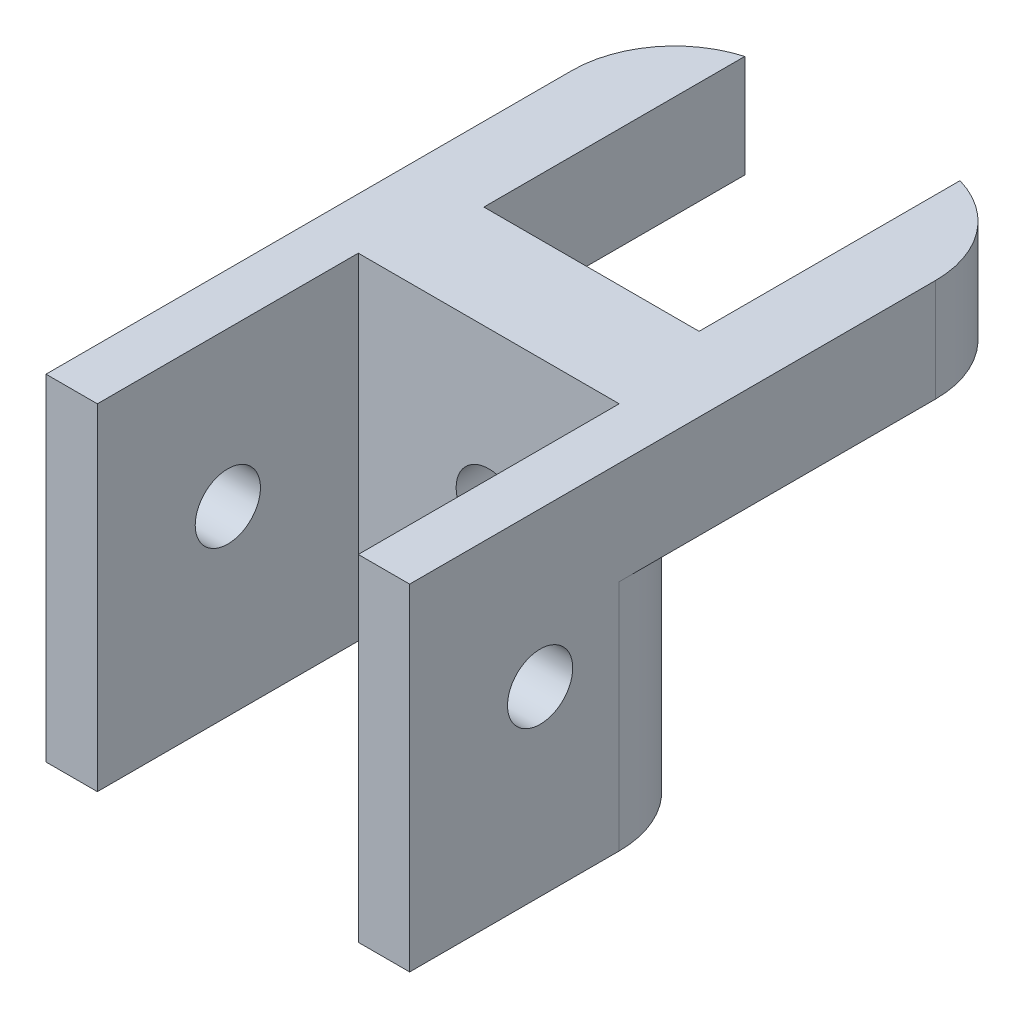
ISO-10303-21;
HEADER;
FILE_DESCRIPTION(('STEP AP214'),'2;1');
FILE_NAME('part.step','',(''),(''),'','','');
FILE_SCHEMA(('AUTOMOTIVE_DESIGN { 1 0 10303 214 1 1 1 1 }'));
ENDSEC;
DATA;
#1=APPLICATION_CONTEXT('core data for automotive mechanical design processes');
#2=APPLICATION_PROTOCOL_DEFINITION('international standard','automotive_design',2000,#1);
#3=PRODUCT_CONTEXT('',#1,'mechanical');
#4=PRODUCT('Part','Part','',(#3));
#5=PRODUCT_RELATED_PRODUCT_CATEGORY('part','',(#4));
#6=PRODUCT_DEFINITION_FORMATION('','',#4);
#7=PRODUCT_DEFINITION_CONTEXT('part definition',#1,'design');
#8=PRODUCT_DEFINITION('design','',#6,#7);
#9=PRODUCT_DEFINITION_SHAPE('','',#8);
#10=(LENGTH_UNIT() NAMED_UNIT(*) SI_UNIT(.MILLI.,.METRE.));
#11=(NAMED_UNIT(*) PLANE_ANGLE_UNIT() SI_UNIT($,.RADIAN.));
#12=(NAMED_UNIT(*) SI_UNIT($,.STERADIAN.) SOLID_ANGLE_UNIT());
#13=UNCERTAINTY_MEASURE_WITH_UNIT(LENGTH_MEASURE(1.E-05),#10,'distance_accuracy_value','');
#14=(GEOMETRIC_REPRESENTATION_CONTEXT(3) GLOBAL_UNCERTAINTY_ASSIGNED_CONTEXT((#13)) GLOBAL_UNIT_ASSIGNED_CONTEXT((#10,
#11,#12)) REPRESENTATION_CONTEXT('',''));
#15=CARTESIAN_POINT('',(0.,0.,0.));
#16=DIRECTION('',(0.,0.,1.));
#17=DIRECTION('',(1.,0.,0.));
#18=AXIS2_PLACEMENT_3D('',#15,#16,#17);
#19=CARTESIAN_POINT('',(-17.7,-10.,10.605));
#20=DIRECTION('',(0.,0.,1.));
#21=DIRECTION('',(1.,0.,0.));
#22=AXIS2_PLACEMENT_3D('',#19,#20,#21);
#23=PLANE('',#22);
#24=DIRECTION('',(0.,-1.,0.));
#25=VECTOR('',#24,1.);
#26=CARTESIAN_POINT('',(-10.475,-10.,10.605));
#27=LINE('',#26,#25);
#28=CARTESIAN_POINT('',(-10.475,0.,10.605));
#29=VERTEX_POINT('',#28);
#30=CARTESIAN_POINT('',(-10.475,-10.,10.605));
#31=VERTEX_POINT('',#30);
#32=EDGE_CURVE('E183',#29,#31,#27,.T.);
#33=ORIENTED_EDGE('',*,*,#32,.F.);
#34=DIRECTION('',(1.,0.,0.));
#35=VECTOR('',#34,1.);
#36=CARTESIAN_POINT('',(-17.7,0.,10.605));
#37=LINE('',#36,#35);
#38=CARTESIAN_POINT('',(10.475,0.,10.605));
#39=VERTEX_POINT('',#38);
#40=EDGE_CURVE('E172',#29,#39,#37,.T.);
#41=ORIENTED_EDGE('',*,*,#40,.T.);
#42=DIRECTION('',(0.,1.,0.));
#43=VECTOR('',#42,1.);
#44=CARTESIAN_POINT('',(10.475,-10.,10.605));
#45=LINE('',#44,#43);
#46=CARTESIAN_POINT('',(10.475,-10.,10.605));
#47=VERTEX_POINT('',#46);
#48=EDGE_CURVE('E188',#47,#39,#45,.T.);
#49=ORIENTED_EDGE('',*,*,#48,.F.);
#50=DIRECTION('',(1.,0.,0.));
#51=VECTOR('',#50,1.);
#52=CARTESIAN_POINT('',(-17.7,-10.,10.605));
#53=LINE('',#52,#51);
#54=EDGE_CURVE('E300',#31,#47,#53,.T.);
#55=ORIENTED_EDGE('',*,*,#54,.F.);
#56=EDGE_LOOP('',(#33,#41,#49,#55));
#57=FACE_BOUND('',#56,.T.);
#58=ADVANCED_FACE('F45',(#57),#23,.F.);
#59=CARTESIAN_POINT('',(-17.7,-10.,20.605));
#60=DIRECTION('',(0.,0.,-1.));
#61=DIRECTION('',(-1.,0.,0.));
#62=AXIS2_PLACEMENT_3D('',#59,#60,#61);
#63=PLANE('',#62);
#64=CARTESIAN_POINT('',(0.,-15.,20.605));
#65=DIRECTION('',(0.,0.,-1.));
#66=DIRECTION('',(-1.,0.,0.));
#67=AXIS2_PLACEMENT_3D('',#64,#65,#66);
#68=CIRCLE('',#67,3.175);
#69=CARTESIAN_POINT('',(-3.175,-15.,20.605));
#70=VERTEX_POINT('',#69);
#71=EDGE_CURVE('E274',#70,#70,#68,.T.);
#72=ORIENTED_EDGE('',*,*,#71,.T.);
#73=EDGE_LOOP('',(#72));
#74=FACE_BOUND('',#73,.T.);
#75=DIRECTION('',(0.,1.,0.));
#76=VECTOR('',#75,1.);
#77=CARTESIAN_POINT('',(-12.7,0.,20.605));
#78=LINE('',#77,#76);
#79=CARTESIAN_POINT('',(-12.7,-32.7,20.605));
#80=VERTEX_POINT('',#79);
#81=CARTESIAN_POINT('',(-12.7,0.,20.605));
#82=VERTEX_POINT('',#81);
#83=EDGE_CURVE('E223',#80,#82,#78,.T.);
#84=ORIENTED_EDGE('',*,*,#83,.F.);
#85=DIRECTION('',(-1.,0.,0.));
#86=VECTOR('',#85,1.);
#87=CARTESIAN_POINT('',(-17.7,-32.7,20.605));
#88=LINE('',#87,#86);
#89=CARTESIAN_POINT('',(12.7,-32.7,20.605));
#90=VERTEX_POINT('',#89);
#91=EDGE_CURVE('E290',#90,#80,#88,.T.);
#92=ORIENTED_EDGE('',*,*,#91,.F.);
#93=DIRECTION('',(0.,-1.,0.));
#94=VECTOR('',#93,1.);
#95=CARTESIAN_POINT('',(12.7,0.,20.605));
#96=LINE('',#95,#94);
#97=CARTESIAN_POINT('',(12.7,0.,20.605));
#98=VERTEX_POINT('',#97);
#99=EDGE_CURVE('E237',#98,#90,#96,.T.);
#100=ORIENTED_EDGE('',*,*,#99,.F.);
#101=DIRECTION('',(-1.,0.,0.));
#102=VECTOR('',#101,1.);
#103=CARTESIAN_POINT('',(-17.7,0.,20.605));
#104=LINE('',#103,#102);
#105=EDGE_CURVE('E301',#98,#82,#104,.T.);
#106=ORIENTED_EDGE('',*,*,#105,.T.);
#107=EDGE_LOOP('',(#84,#92,#100,#106));
#108=FACE_BOUND('',#107,.T.);
#109=ADVANCED_FACE('F414',(#74,#108),#63,.F.);
#110=CARTESIAN_POINT('',(0.,-10.,0.));
#111=DIRECTION('',(0.,1.,0.));
#112=DIRECTION('',(0.,0.,1.));
#113=AXIS2_PLACEMENT_3D('',#110,#111,#112);
#114=PLANE('',#113);
#115=DIRECTION('',(0.,0.,1.));
#116=VECTOR('',#115,1.);
#117=CARTESIAN_POINT('',(10.475,-10.,-14.795));
#118=LINE('',#117,#116);
#119=CARTESIAN_POINT('',(10.475,-10.,-14.795));
#120=VERTEX_POINT('',#119);
#121=EDGE_CURVE('E191',#120,#47,#118,.T.);
#122=ORIENTED_EDGE('',*,*,#121,.F.);
#123=CARTESIAN_POINT('',(7.7,-10.,-5.18774362786127));
#124=DIRECTION('',(0.,1.,0.));
#125=DIRECTION('',(0.,0.,1.));
#126=AXIS2_PLACEMENT_3D('',#123,#124,#125);
#127=CIRCLE('',#126,10.);
#128=CARTESIAN_POINT('',(17.7,-10.,-5.18774362786127));
#129=VERTEX_POINT('',#128);
#130=EDGE_CURVE('E164',#120,#129,#127,.F.);
#131=ORIENTED_EDGE('',*,*,#130,.T.);
#132=DIRECTION('',(0.,0.,1.));
#133=VECTOR('',#132,1.);
#134=CARTESIAN_POINT('',(17.7,-10.,10.605));
#135=LINE('',#134,#133);
#136=CARTESIAN_POINT('',(17.7,-10.,25.605));
#137=VERTEX_POINT('',#136);
#138=EDGE_CURVE('E305',#129,#137,#135,.T.);
#139=ORIENTED_EDGE('',*,*,#138,.T.);
#140=CARTESIAN_POINT('',(7.7,-10.,25.605));
#141=DIRECTION('',(0.,1.,0.));
#142=DIRECTION('',(0.,0.,1.));
#143=AXIS2_PLACEMENT_3D('',#140,#141,#142);
#144=CIRCLE('',#143,10.);
#145=CARTESIAN_POINT('',(7.7,-10.,15.605));
#146=VERTEX_POINT('',#145);
#147=EDGE_CURVE('E54',#137,#146,#144,.T.);
#148=ORIENTED_EDGE('',*,*,#147,.T.);
#149=DIRECTION('',(1.,0.,0.));
#150=VECTOR('',#149,1.);
#151=CARTESIAN_POINT('',(-17.7,-10.,15.605));
#152=LINE('',#151,#150);
#153=CARTESIAN_POINT('',(-7.7,-10.,15.605));
#154=VERTEX_POINT('',#153);
#155=EDGE_CURVE('E278',#154,#146,#152,.T.);
#156=ORIENTED_EDGE('',*,*,#155,.F.);
#157=CARTESIAN_POINT('',(-7.7,-10.,25.605));
#158=DIRECTION('',(0.,1.,0.));
#159=DIRECTION('',(0.,0.,1.));
#160=AXIS2_PLACEMENT_3D('',#157,#158,#159);
#161=CIRCLE('',#160,10.);
#162=CARTESIAN_POINT('',(-17.7,-10.,25.605));
#163=VERTEX_POINT('',#162);
#164=EDGE_CURVE('E11',#154,#163,#161,.T.);
#165=ORIENTED_EDGE('',*,*,#164,.T.);
#166=DIRECTION('',(0.,0.,-1.));
#167=VECTOR('',#166,1.);
#168=CARTESIAN_POINT('',(-17.7,-10.,10.605));
#169=LINE('',#168,#167);
#170=CARTESIAN_POINT('',(-17.7,-10.,-5.18774362786127));
#171=VERTEX_POINT('',#170);
#172=EDGE_CURVE('E61',#163,#171,#169,.T.);
#173=ORIENTED_EDGE('',*,*,#172,.T.);
#174=CARTESIAN_POINT('',(-7.70000000000001,-10.,-5.18774362786127));
#175=DIRECTION('',(0.,1.,0.));
#176=DIRECTION('',(0.,0.,1.));
#177=AXIS2_PLACEMENT_3D('',#174,#175,#176);
#178=CIRCLE('',#177,10.);
#179=CARTESIAN_POINT('',(-10.475,-10.,-14.795));
#180=VERTEX_POINT('',#179);
#181=EDGE_CURVE('E345',#171,#180,#178,.F.);
#182=ORIENTED_EDGE('',*,*,#181,.T.);
#183=DIRECTION('',(0.,0.,1.));
#184=VECTOR('',#183,1.);
#185=CARTESIAN_POINT('',(-10.475,-10.,-14.795));
#186=LINE('',#185,#184);
#187=EDGE_CURVE('E177',#180,#31,#186,.T.);
#188=ORIENTED_EDGE('',*,*,#187,.T.);
#189=ORIENTED_EDGE('',*,*,#54,.T.);
#190=EDGE_LOOP('',(#122,#131,#139,#148,#156,#165,#173,#182,#188,#189));
#191=FACE_BOUND('',#190,.T.);
#192=ADVANCED_FACE('F356',(#191),#114,.F.);
#193=CARTESIAN_POINT('',(-17.7,-10.,10.605));
#194=DIRECTION('',(1.,0.,0.));
#195=DIRECTION('',(0.,0.,-1.));
#196=AXIS2_PLACEMENT_3D('',#193,#194,#195);
#197=PLANE('',#196);
#198=CARTESIAN_POINT('',(-17.7,-15.,33.305));
#199=DIRECTION('',(1.,0.,0.));
#200=DIRECTION('',(0.,0.,-1.));
#201=AXIS2_PLACEMENT_3D('',#198,#199,#200);
#202=CIRCLE('',#201,3.175);
#203=CARTESIAN_POINT('',(-17.7,-15.,30.13));
#204=VERTEX_POINT('',#203);
#205=EDGE_CURVE('E213',#204,#204,#202,.T.);
#206=ORIENTED_EDGE('',*,*,#205,.T.);
#207=EDGE_LOOP('',(#206));
#208=FACE_BOUND('',#207,.T.);
#209=ORIENTED_EDGE('',*,*,#172,.F.);
#210=DIRECTION('',(0.,1.,0.));
#211=VECTOR('',#210,1.);
#212=CARTESIAN_POINT('',(-17.7,-10.,25.605));
#213=LINE('',#212,#211);
#214=CARTESIAN_POINT('',(-17.7,-32.7,25.605));
#215=VERTEX_POINT('',#214);
#216=EDGE_CURVE('E342',#163,#215,#213,.F.);
#217=ORIENTED_EDGE('',*,*,#216,.T.);
#218=DIRECTION('',(0.,0.,-1.));
#219=VECTOR('',#218,1.);
#220=CARTESIAN_POINT('',(-17.7,-32.7,20.605));
#221=LINE('',#220,#219);
#222=CARTESIAN_POINT('',(-17.7,-32.7,46.005));
#223=VERTEX_POINT('',#222);
#224=EDGE_CURVE('E279',#223,#215,#221,.T.);
#225=ORIENTED_EDGE('',*,*,#224,.F.);
#226=DIRECTION('',(0.,-1.,0.));
#227=VECTOR('',#226,1.);
#228=CARTESIAN_POINT('',(-17.7,0.,46.005));
#229=LINE('',#228,#227);
#230=CARTESIAN_POINT('',(-17.7,0.,46.005));
#231=VERTEX_POINT('',#230);
#232=EDGE_CURVE('E218',#231,#223,#229,.T.);
#233=ORIENTED_EDGE('',*,*,#232,.F.);
#234=DIRECTION('',(0.,0.,-1.));
#235=VECTOR('',#234,1.);
#236=CARTESIAN_POINT('',(-17.7,0.,10.605));
#237=LINE('',#236,#235);
#238=CARTESIAN_POINT('',(-17.7,0.,-5.18774362786127));
#239=VERTEX_POINT('',#238);
#240=EDGE_CURVE('E294',#231,#239,#237,.T.);
#241=ORIENTED_EDGE('',*,*,#240,.T.);
#242=DIRECTION('',(0.,1.,0.));
#243=VECTOR('',#242,1.);
#244=CARTESIAN_POINT('',(-17.7,-10.,-5.18774362786127));
#245=LINE('',#244,#243);
#246=EDGE_CURVE('E65',#239,#171,#245,.F.);
#247=ORIENTED_EDGE('',*,*,#246,.T.);
#248=EDGE_LOOP('',(#209,#217,#225,#233,#241,#247));
#249=FACE_BOUND('',#248,.T.);
#250=ADVANCED_FACE('F425',(#208,#249),#197,.F.);
#251=CARTESIAN_POINT('',(17.7,-10.,10.605));
#252=DIRECTION('',(-1.,0.,0.));
#253=DIRECTION('',(0.,0.,1.));
#254=AXIS2_PLACEMENT_3D('',#251,#252,#253);
#255=PLANE('',#254);
#256=CARTESIAN_POINT('',(17.7,-15.,33.305));
#257=DIRECTION('',(1.,0.,0.));
#258=DIRECTION('',(0.,0.,-1.));
#259=AXIS2_PLACEMENT_3D('',#256,#257,#258);
#260=CIRCLE('',#259,3.175);
#261=CARTESIAN_POINT('',(17.7,-15.,30.13));
#262=VERTEX_POINT('',#261);
#263=EDGE_CURVE('E176',#262,#262,#260,.T.);
#264=ORIENTED_EDGE('',*,*,#263,.F.);
#265=EDGE_LOOP('',(#264));
#266=FACE_BOUND('',#265,.T.);
#267=DIRECTION('',(0.,0.,1.));
#268=VECTOR('',#267,1.);
#269=CARTESIAN_POINT('',(17.7,-32.7,20.605));
#270=LINE('',#269,#268);
#271=CARTESIAN_POINT('',(17.7,-32.7,25.605));
#272=VERTEX_POINT('',#271);
#273=CARTESIAN_POINT('',(17.7,-32.7,46.005));
#274=VERTEX_POINT('',#273);
#275=EDGE_CURVE('E287',#272,#274,#270,.T.);
#276=ORIENTED_EDGE('',*,*,#275,.F.);
#277=DIRECTION('',(0.,1.,0.));
#278=VECTOR('',#277,1.);
#279=CARTESIAN_POINT('',(17.7,-10.,25.605));
#280=LINE('',#279,#278);
#281=EDGE_CURVE('E323',#272,#137,#280,.T.);
#282=ORIENTED_EDGE('',*,*,#281,.T.);
#283=ORIENTED_EDGE('',*,*,#138,.F.);
#284=DIRECTION('',(0.,1.,0.));
#285=VECTOR('',#284,1.);
#286=CARTESIAN_POINT('',(17.7,-10.,-5.18774362786127));
#287=LINE('',#286,#285);
#288=CARTESIAN_POINT('',(17.7,0.,-5.18774362786127));
#289=VERTEX_POINT('',#288);
#290=EDGE_CURVE('E308',#129,#289,#287,.T.);
#291=ORIENTED_EDGE('',*,*,#290,.T.);
#292=DIRECTION('',(0.,0.,1.));
#293=VECTOR('',#292,1.);
#294=CARTESIAN_POINT('',(17.7,0.,10.605));
#295=LINE('',#294,#293);
#296=CARTESIAN_POINT('',(17.7,0.,46.005));
#297=VERTEX_POINT('',#296);
#298=EDGE_CURVE('E313',#289,#297,#295,.T.);
#299=ORIENTED_EDGE('',*,*,#298,.T.);
#300=DIRECTION('',(0.,1.,0.));
#301=VECTOR('',#300,1.);
#302=CARTESIAN_POINT('',(17.7,0.,46.005));
#303=LINE('',#302,#301);
#304=EDGE_CURVE('E260',#274,#297,#303,.T.);
#305=ORIENTED_EDGE('',*,*,#304,.F.);
#306=EDGE_LOOP('',(#276,#282,#283,#291,#299,#305));
#307=FACE_BOUND('',#306,.T.);
#308=ADVANCED_FACE('F372',(#266,#307),#255,.F.);
#309=CARTESIAN_POINT('',(0.,0.,0.));
#310=DIRECTION('',(0.,1.,0.));
#311=DIRECTION('',(0.,0.,1.));
#312=AXIS2_PLACEMENT_3D('',#309,#310,#311);
#313=PLANE('',#312);
#314=ORIENTED_EDGE('',*,*,#298,.F.);
#315=CARTESIAN_POINT('',(7.7,0.,-5.18774362786127));
#316=DIRECTION('',(0.,1.,0.));
#317=DIRECTION('',(0.,0.,1.));
#318=AXIS2_PLACEMENT_3D('',#315,#316,#317);
#319=CIRCLE('',#318,10.);
#320=CARTESIAN_POINT('',(10.475,0.,-14.795));
#321=VERTEX_POINT('',#320);
#322=EDGE_CURVE('E163',#289,#321,#319,.T.);
#323=ORIENTED_EDGE('',*,*,#322,.T.);
#324=DIRECTION('',(0.,0.,1.));
#325=VECTOR('',#324,1.);
#326=CARTESIAN_POINT('',(10.475,0.,-14.795));
#327=LINE('',#326,#325);
#328=EDGE_CURVE('E195',#321,#39,#327,.T.);
#329=ORIENTED_EDGE('',*,*,#328,.T.);
#330=ORIENTED_EDGE('',*,*,#40,.F.);
#331=DIRECTION('',(0.,0.,1.));
#332=VECTOR('',#331,1.);
#333=CARTESIAN_POINT('',(-10.475,0.,-14.795));
#334=LINE('',#333,#332);
#335=CARTESIAN_POINT('',(-10.475,0.,-14.795));
#336=VERTEX_POINT('',#335);
#337=EDGE_CURVE('E168',#336,#29,#334,.T.);
#338=ORIENTED_EDGE('',*,*,#337,.F.);
#339=CARTESIAN_POINT('',(-7.70000000000001,0.,-5.18774362786127));
#340=DIRECTION('',(0.,1.,0.));
#341=DIRECTION('',(0.,0.,1.));
#342=AXIS2_PLACEMENT_3D('',#339,#340,#341);
#343=CIRCLE('',#342,10.);
#344=EDGE_CURVE('E156',#336,#239,#343,.T.);
#345=ORIENTED_EDGE('',*,*,#344,.T.);
#346=ORIENTED_EDGE('',*,*,#240,.F.);
#347=DIRECTION('',(-1.,0.,0.));
#348=VECTOR('',#347,1.);
#349=CARTESIAN_POINT('',(-17.7,0.,46.005));
#350=LINE('',#349,#348);
#351=CARTESIAN_POINT('',(-12.7,0.,46.005));
#352=VERTEX_POINT('',#351);
#353=EDGE_CURVE('E229',#352,#231,#350,.T.);
#354=ORIENTED_EDGE('',*,*,#353,.F.);
#355=DIRECTION('',(0.,0.,-1.));
#356=VECTOR('',#355,1.);
#357=CARTESIAN_POINT('',(-12.7,0.,46.005));
#358=LINE('',#357,#356);
#359=EDGE_CURVE('E233',#352,#82,#358,.T.);
#360=ORIENTED_EDGE('',*,*,#359,.T.);
#361=ORIENTED_EDGE('',*,*,#105,.F.);
#362=DIRECTION('',(0.,0.,-1.));
#363=VECTOR('',#362,1.);
#364=CARTESIAN_POINT('',(12.7,0.,46.005));
#365=LINE('',#364,#363);
#366=CARTESIAN_POINT('',(12.7,0.,46.005));
#367=VERTEX_POINT('',#366);
#368=EDGE_CURVE('E249',#367,#98,#365,.T.);
#369=ORIENTED_EDGE('',*,*,#368,.F.);
#370=DIRECTION('',(-1.,0.,0.));
#371=VECTOR('',#370,1.);
#372=CARTESIAN_POINT('',(12.7,0.,46.005));
#373=LINE('',#372,#371);
#374=EDGE_CURVE('E253',#297,#367,#373,.T.);
#375=ORIENTED_EDGE('',*,*,#374,.F.);
#376=EDGE_LOOP('',(#314,#323,#329,#330,#338,#345,#346,#354,#360,#361,#369,#375));
#377=FACE_BOUND('',#376,.T.);
#378=ADVANCED_FACE('F170',(#377),#313,.T.);
#379=CARTESIAN_POINT('',(-17.7,-32.7,15.605));
#380=DIRECTION('',(0.,0.,1.));
#381=DIRECTION('',(1.,0.,0.));
#382=AXIS2_PLACEMENT_3D('',#379,#380,#381);
#383=PLANE('',#382);
#384=CARTESIAN_POINT('',(0.,-15.,15.605));
#385=DIRECTION('',(0.,0.,-1.));
#386=DIRECTION('',(-1.,0.,0.));
#387=AXIS2_PLACEMENT_3D('',#384,#385,#386);
#388=CIRCLE('',#387,3.175);
#389=CARTESIAN_POINT('',(-3.175,-15.,15.605));
#390=VERTEX_POINT('',#389);
#391=EDGE_CURVE('E245',#390,#390,#388,.T.);
#392=ORIENTED_EDGE('',*,*,#391,.F.);
#393=EDGE_LOOP('',(#392));
#394=FACE_BOUND('',#393,.T.);
#395=ORIENTED_EDGE('',*,*,#155,.T.);
#396=DIRECTION('',(0.,1.,0.));
#397=VECTOR('',#396,1.);
#398=CARTESIAN_POINT('',(7.7,-32.7,15.605));
#399=LINE('',#398,#397);
#400=CARTESIAN_POINT('',(7.7,-32.7,15.605));
#401=VERTEX_POINT('',#400);
#402=EDGE_CURVE('E331',#146,#401,#399,.F.);
#403=ORIENTED_EDGE('',*,*,#402,.T.);
#404=DIRECTION('',(1.,0.,0.));
#405=VECTOR('',#404,1.);
#406=CARTESIAN_POINT('',(-17.7,-32.7,15.605));
#407=LINE('',#406,#405);
#408=CARTESIAN_POINT('',(-7.7,-32.7,15.605));
#409=VERTEX_POINT('',#408);
#410=EDGE_CURVE('E283',#409,#401,#407,.T.);
#411=ORIENTED_EDGE('',*,*,#410,.F.);
#412=DIRECTION('',(0.,1.,0.));
#413=VECTOR('',#412,1.);
#414=CARTESIAN_POINT('',(-7.7,-32.7,15.605));
#415=LINE('',#414,#413);
#416=EDGE_CURVE('E327',#409,#154,#415,.T.);
#417=ORIENTED_EDGE('',*,*,#416,.T.);
#418=EDGE_LOOP('',(#395,#403,#411,#417));
#419=FACE_BOUND('',#418,.T.);
#420=ADVANCED_FACE('F362',(#394,#419),#383,.F.);
#421=CARTESIAN_POINT('',(0.,-32.7,0.));
#422=DIRECTION('',(0.,-1.,0.));
#423=DIRECTION('',(0.,0.,-1.));
#424=AXIS2_PLACEMENT_3D('',#421,#422,#423);
#425=PLANE('',#424);
#426=ORIENTED_EDGE('',*,*,#410,.T.);
#427=CARTESIAN_POINT('',(7.7,-32.7,25.605));
#428=DIRECTION('',(0.,-1.,0.));
#429=DIRECTION('',(0.,0.,-1.));
#430=AXIS2_PLACEMENT_3D('',#427,#428,#429);
#431=CIRCLE('',#430,10.);
#432=EDGE_CURVE('E337',#401,#272,#431,.T.);
#433=ORIENTED_EDGE('',*,*,#432,.T.);
#434=ORIENTED_EDGE('',*,*,#275,.T.);
#435=DIRECTION('',(1.,0.,0.));
#436=VECTOR('',#435,1.);
#437=CARTESIAN_POINT('',(12.7,-32.7,46.005));
#438=LINE('',#437,#436);
#439=CARTESIAN_POINT('',(12.7,-32.7,46.005));
#440=VERTEX_POINT('',#439);
#441=EDGE_CURVE('E264',#440,#274,#438,.T.);
#442=ORIENTED_EDGE('',*,*,#441,.F.);
#443=DIRECTION('',(0.,0.,-1.));
#444=VECTOR('',#443,1.);
#445=CARTESIAN_POINT('',(12.7,-32.7,46.005));
#446=LINE('',#445,#444);
#447=EDGE_CURVE('E217',#440,#90,#446,.T.);
#448=ORIENTED_EDGE('',*,*,#447,.T.);
#449=ORIENTED_EDGE('',*,*,#91,.T.);
#450=DIRECTION('',(0.,0.,-1.));
#451=VECTOR('',#450,1.);
#452=CARTESIAN_POINT('',(-12.7,-32.7,46.005));
#453=LINE('',#452,#451);
#454=CARTESIAN_POINT('',(-12.7,-32.7,46.005));
#455=VERTEX_POINT('',#454);
#456=EDGE_CURVE('E241',#455,#80,#453,.T.);
#457=ORIENTED_EDGE('',*,*,#456,.F.);
#458=DIRECTION('',(1.,0.,0.));
#459=VECTOR('',#458,1.);
#460=CARTESIAN_POINT('',(-17.7,-32.7,46.005));
#461=LINE('',#460,#459);
#462=EDGE_CURVE('E222',#223,#455,#461,.T.);
#463=ORIENTED_EDGE('',*,*,#462,.F.);
#464=ORIENTED_EDGE('',*,*,#224,.T.);
#465=CARTESIAN_POINT('',(-7.7,-32.7,25.605));
#466=DIRECTION('',(0.,-1.,0.));
#467=DIRECTION('',(0.,0.,-1.));
#468=AXIS2_PLACEMENT_3D('',#465,#466,#467);
#469=CIRCLE('',#468,10.);
#470=EDGE_CURVE('E334',#215,#409,#469,.T.);
#471=ORIENTED_EDGE('',*,*,#470,.T.);
#472=EDGE_LOOP('',(#426,#433,#434,#442,#448,#449,#457,#463,#464,#471));
#473=FACE_BOUND('',#472,.T.);
#474=ADVANCED_FACE('F369',(#473),#425,.T.);
#475=CARTESIAN_POINT('',(0.,-15.,46.005));
#476=DIRECTION('',(0.,0.,-1.));
#477=DIRECTION('',(-1.,0.,0.));
#478=AXIS2_PLACEMENT_3D('',#475,#476,#477);
#479=CYLINDRICAL_SURFACE('',#478,3.175);
#480=ORIENTED_EDGE('',*,*,#391,.T.);
#481=EDGE_LOOP('',(#480));
#482=FACE_BOUND('',#481,.T.);
#483=ORIENTED_EDGE('',*,*,#71,.F.);
#484=EDGE_LOOP('',(#483));
#485=FACE_BOUND('',#484,.T.);
#486=ADVANCED_FACE('F453',(#482,#485),#479,.F.);
#487=CARTESIAN_POINT('',(12.7,0.,46.005));
#488=DIRECTION('',(1.,0.,0.));
#489=DIRECTION('',(0.,1.,0.));
#490=AXIS2_PLACEMENT_3D('',#487,#488,#489);
#491=PLANE('',#490);
#492=CARTESIAN_POINT('',(12.7,-15.,33.305));
#493=DIRECTION('',(1.,0.,0.));
#494=DIRECTION('',(0.,1.,0.));
#495=AXIS2_PLACEMENT_3D('',#492,#493,#494);
#496=CIRCLE('',#495,3.175);
#497=CARTESIAN_POINT('',(12.7,-11.825,33.305));
#498=VERTEX_POINT('',#497);
#499=EDGE_CURVE('E209',#498,#498,#496,.T.);
#500=ORIENTED_EDGE('',*,*,#499,.T.);
#501=EDGE_LOOP('',(#500));
#502=FACE_BOUND('',#501,.T.);
#503=ORIENTED_EDGE('',*,*,#99,.T.);
#504=ORIENTED_EDGE('',*,*,#447,.F.);
#505=DIRECTION('',(0.,-1.,0.));
#506=VECTOR('',#505,1.);
#507=CARTESIAN_POINT('',(12.7,0.,46.005));
#508=LINE('',#507,#506);
#509=EDGE_CURVE('E257',#367,#440,#508,.T.);
#510=ORIENTED_EDGE('',*,*,#509,.F.);
#511=ORIENTED_EDGE('',*,*,#368,.T.);
#512=EDGE_LOOP('',(#503,#504,#510,#511));
#513=FACE_BOUND('',#512,.T.);
#514=ADVANCED_FACE('F382',(#502,#513),#491,.F.);
#515=CARTESIAN_POINT('',(0.,0.,46.005));
#516=DIRECTION('',(0.,0.,1.));
#517=DIRECTION('',(1.,0.,0.));
#518=AXIS2_PLACEMENT_3D('',#515,#516,#517);
#519=PLANE('',#518);
#520=ORIENTED_EDGE('',*,*,#509,.T.);
#521=ORIENTED_EDGE('',*,*,#441,.T.);
#522=ORIENTED_EDGE('',*,*,#304,.T.);
#523=ORIENTED_EDGE('',*,*,#374,.T.);
#524=EDGE_LOOP('',(#520,#521,#522,#523));
#525=FACE_BOUND('',#524,.T.);
#526=ADVANCED_FACE('F375',(#525),#519,.T.);
#527=CARTESIAN_POINT('',(-12.7,0.,46.005));
#528=DIRECTION('',(-1.,0.,0.));
#529=DIRECTION('',(0.,0.,1.));
#530=AXIS2_PLACEMENT_3D('',#527,#528,#529);
#531=PLANE('',#530);
#532=CARTESIAN_POINT('',(-12.7,-15.,33.305));
#533=DIRECTION('',(-1.,0.,0.));
#534=DIRECTION('',(0.,0.,1.));
#535=AXIS2_PLACEMENT_3D('',#532,#533,#534);
#536=CIRCLE('',#535,3.175);
#537=CARTESIAN_POINT('',(-12.7,-15.,36.48));
#538=VERTEX_POINT('',#537);
#539=EDGE_CURVE('E208',#538,#538,#536,.T.);
#540=ORIENTED_EDGE('',*,*,#539,.T.);
#541=EDGE_LOOP('',(#540));
#542=FACE_BOUND('',#541,.T.);
#543=ORIENTED_EDGE('',*,*,#83,.T.);
#544=ORIENTED_EDGE('',*,*,#359,.F.);
#545=DIRECTION('',(0.,1.,0.));
#546=VECTOR('',#545,1.);
#547=CARTESIAN_POINT('',(-12.7,0.,46.005));
#548=LINE('',#547,#546);
#549=EDGE_CURVE('E226',#455,#352,#548,.T.);
#550=ORIENTED_EDGE('',*,*,#549,.F.);
#551=ORIENTED_EDGE('',*,*,#456,.T.);
#552=EDGE_LOOP('',(#543,#544,#550,#551));
#553=FACE_BOUND('',#552,.T.);
#554=ADVANCED_FACE('F388',(#542,#553),#531,.F.);
#555=CARTESIAN_POINT('',(0.,0.,46.005));
#556=DIRECTION('',(0.,0.,1.));
#557=DIRECTION('',(1.,0.,0.));
#558=AXIS2_PLACEMENT_3D('',#555,#556,#557);
#559=PLANE('',#558);
#560=ORIENTED_EDGE('',*,*,#232,.T.);
#561=ORIENTED_EDGE('',*,*,#462,.T.);
#562=ORIENTED_EDGE('',*,*,#549,.T.);
#563=ORIENTED_EDGE('',*,*,#353,.T.);
#564=EDGE_LOOP('',(#560,#561,#562,#563));
#565=FACE_BOUND('',#564,.T.);
#566=ADVANCED_FACE('F392',(#565),#559,.T.);
#567=CARTESIAN_POINT('',(-19.5338143213269,-15.,33.305));
#568=DIRECTION('',(1.,0.,0.));
#569=DIRECTION('',(0.,0.,-1.));
#570=AXIS2_PLACEMENT_3D('',#567,#568,#569);
#571=CYLINDRICAL_SURFACE('',#570,3.175);
#572=ORIENTED_EDGE('',*,*,#539,.F.);
#573=EDGE_LOOP('',(#572));
#574=FACE_BOUND('',#573,.T.);
#575=ORIENTED_EDGE('',*,*,#205,.F.);
#576=EDGE_LOOP('',(#575));
#577=FACE_BOUND('',#576,.T.);
#578=ADVANCED_FACE('F442',(#574,#577),#571,.F.);
#579=ORIENTED_EDGE('',*,*,#263,.T.);
#580=EDGE_LOOP('',(#579));
#581=FACE_BOUND('',#580,.T.);
#582=ORIENTED_EDGE('',*,*,#499,.F.);
#583=EDGE_LOOP('',(#582));
#584=FACE_BOUND('',#583,.T.);
#585=ADVANCED_FACE('F439',(#581,#584),#571,.F.);
#586=CARTESIAN_POINT('',(10.475,-10.,-14.795));
#587=DIRECTION('',(1.,0.,0.));
#588=DIRECTION('',(0.,0.,-1.));
#589=AXIS2_PLACEMENT_3D('',#586,#587,#588);
#590=PLANE('',#589);
#591=ORIENTED_EDGE('',*,*,#48,.T.);
#592=ORIENTED_EDGE('',*,*,#328,.F.);
#593=DIRECTION('',(0.,1.,0.));
#594=VECTOR('',#593,1.);
#595=CARTESIAN_POINT('',(10.475,-10.,-14.795));
#596=LINE('',#595,#594);
#597=EDGE_CURVE('E198',#120,#321,#596,.T.);
#598=ORIENTED_EDGE('',*,*,#597,.F.);
#599=ORIENTED_EDGE('',*,*,#121,.T.);
#600=EDGE_LOOP('',(#591,#592,#598,#599));
#601=FACE_BOUND('',#600,.T.);
#602=ADVANCED_FACE('F401',(#601),#590,.F.);
#603=CARTESIAN_POINT('',(-10.475,-10.,-14.795));
#604=DIRECTION('',(-1.,0.,0.));
#605=DIRECTION('',(0.,0.,1.));
#606=AXIS2_PLACEMENT_3D('',#603,#604,#605);
#607=PLANE('',#606);
#608=ORIENTED_EDGE('',*,*,#32,.T.);
#609=ORIENTED_EDGE('',*,*,#187,.F.);
#610=DIRECTION('',(0.,-1.,0.));
#611=VECTOR('',#610,1.);
#612=CARTESIAN_POINT('',(-10.475,-10.,-14.795));
#613=LINE('',#612,#611);
#614=EDGE_CURVE('E160',#336,#180,#613,.T.);
#615=ORIENTED_EDGE('',*,*,#614,.F.);
#616=ORIENTED_EDGE('',*,*,#337,.T.);
#617=EDGE_LOOP('',(#608,#609,#615,#616));
#618=FACE_BOUND('',#617,.T.);
#619=ADVANCED_FACE('F180',(#618),#607,.F.);
#620=CARTESIAN_POINT('',(7.7,-10.,25.605));
#621=DIRECTION('',(0.,1.,0.));
#622=DIRECTION('',(0.,0.,1.));
#623=AXIS2_PLACEMENT_3D('',#620,#621,#622);
#624=CYLINDRICAL_SURFACE('',#623,10.);
#625=ORIENTED_EDGE('',*,*,#432,.F.);
#626=ORIENTED_EDGE('',*,*,#402,.F.);
#627=ORIENTED_EDGE('',*,*,#147,.F.);
#628=ORIENTED_EDGE('',*,*,#281,.F.);
#629=EDGE_LOOP('',(#625,#626,#627,#628));
#630=FACE_BOUND('',#629,.T.);
#631=ADVANCED_FACE('F366',(#630),#624,.T.);
#632=CARTESIAN_POINT('',(-7.7,-32.7,25.605));
#633=DIRECTION('',(0.,1.,0.));
#634=DIRECTION('',(0.,0.,1.));
#635=AXIS2_PLACEMENT_3D('',#632,#633,#634);
#636=CYLINDRICAL_SURFACE('',#635,10.);
#637=ORIENTED_EDGE('',*,*,#470,.F.);
#638=ORIENTED_EDGE('',*,*,#216,.F.);
#639=ORIENTED_EDGE('',*,*,#164,.F.);
#640=ORIENTED_EDGE('',*,*,#416,.F.);
#641=EDGE_LOOP('',(#637,#638,#639,#640));
#642=FACE_BOUND('',#641,.T.);
#643=ADVANCED_FACE('F397',(#642),#636,.T.);
#644=CARTESIAN_POINT('',(7.7,0.,-5.18774362786127));
#645=DIRECTION('',(0.,1.,0.));
#646=DIRECTION('',(0.,0.,1.));
#647=AXIS2_PLACEMENT_3D('',#644,#645,#646);
#648=CYLINDRICAL_SURFACE('',#647,10.);
#649=ORIENTED_EDGE('',*,*,#322,.F.);
#650=ORIENTED_EDGE('',*,*,#290,.F.);
#651=ORIENTED_EDGE('',*,*,#130,.F.);
#652=ORIENTED_EDGE('',*,*,#597,.T.);
#653=EDGE_LOOP('',(#649,#650,#651,#652));
#654=FACE_BOUND('',#653,.T.);
#655=ADVANCED_FACE('F404',(#654),#648,.T.);
#656=CARTESIAN_POINT('',(-7.70000000000001,0.,-5.18774362786127));
#657=DIRECTION('',(0.,1.,0.));
#658=DIRECTION('',(0.,0.,1.));
#659=AXIS2_PLACEMENT_3D('',#656,#657,#658);
#660=CYLINDRICAL_SURFACE('',#659,10.);
#661=ORIENTED_EDGE('',*,*,#181,.F.);
#662=ORIENTED_EDGE('',*,*,#246,.F.);
#663=ORIENTED_EDGE('',*,*,#344,.F.);
#664=ORIENTED_EDGE('',*,*,#614,.T.);
#665=EDGE_LOOP('',(#661,#662,#663,#664));
#666=FACE_BOUND('',#665,.T.);
#667=ADVANCED_FACE('F47',(#666),#660,.T.);
#668=CLOSED_SHELL('',(#58,#109,#192,#250,#308,#378,#420,#474,#486,#514,#526,#554,#566,#578,#585,
#602,#619,#631,#643,#655,#667));
#669=MANIFOLD_SOLID_BREP('B2',#668);
#670=ADVANCED_BREP_SHAPE_REPRESENTATION('',(#18,#669),#14);
#671=SHAPE_DEFINITION_REPRESENTATION(#9,#670);
ENDSEC;
END-ISO-10303-21;
